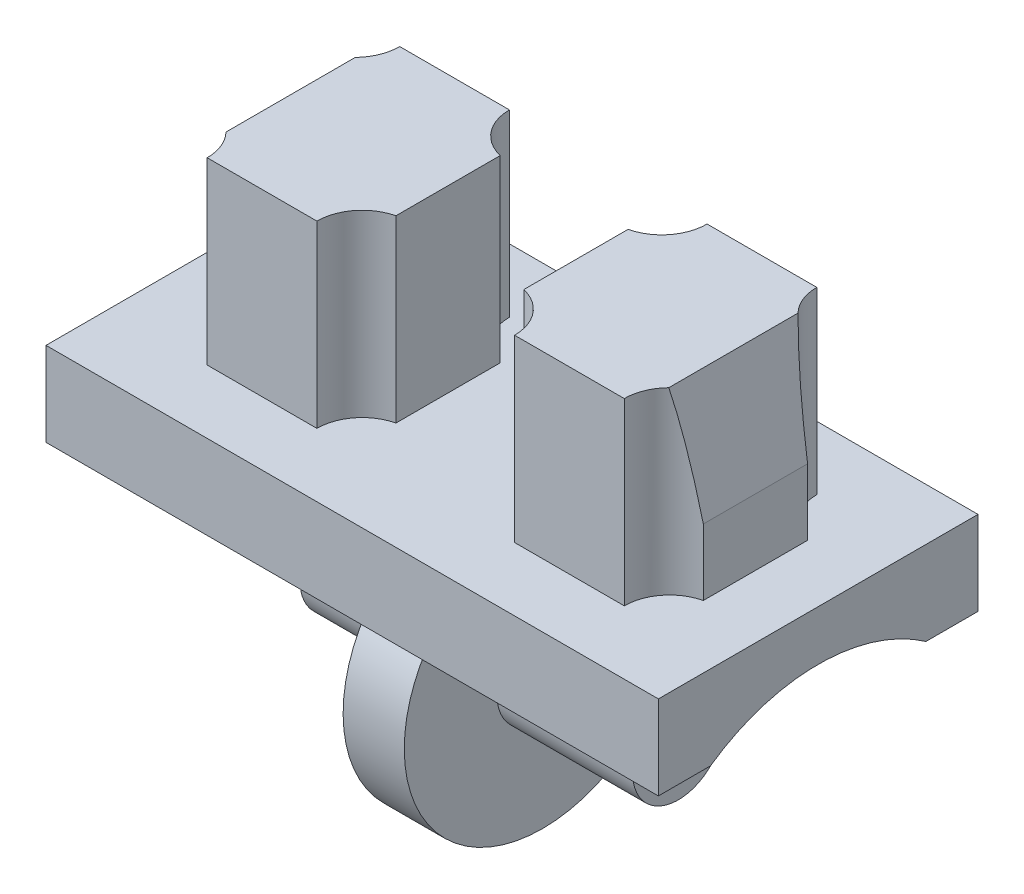
ISO-10303-21;
HEADER;
FILE_DESCRIPTION(('STEP AP214'),'2;1');
FILE_NAME('part.step','',(''),(''),'','','');
FILE_SCHEMA(('AUTOMOTIVE_DESIGN { 1 0 10303 214 1 1 1 1 }'));
ENDSEC;
DATA;
#1=APPLICATION_CONTEXT('core data for automotive mechanical design processes');
#2=APPLICATION_PROTOCOL_DEFINITION('international standard','automotive_design',2000,#1);
#3=PRODUCT_CONTEXT('',#1,'mechanical');
#4=PRODUCT('Part','Part','',(#3));
#5=PRODUCT_RELATED_PRODUCT_CATEGORY('part','',(#4));
#6=PRODUCT_DEFINITION_FORMATION('','',#4);
#7=PRODUCT_DEFINITION_CONTEXT('part definition',#1,'design');
#8=PRODUCT_DEFINITION('design','',#6,#7);
#9=PRODUCT_DEFINITION_SHAPE('','',#8);
#10=(LENGTH_UNIT() NAMED_UNIT(*) SI_UNIT(.MILLI.,.METRE.));
#11=(NAMED_UNIT(*) PLANE_ANGLE_UNIT() SI_UNIT($,.RADIAN.));
#12=(NAMED_UNIT(*) SI_UNIT($,.STERADIAN.) SOLID_ANGLE_UNIT());
#13=UNCERTAINTY_MEASURE_WITH_UNIT(LENGTH_MEASURE(1.E-05),#10,'distance_accuracy_value','');
#14=(GEOMETRIC_REPRESENTATION_CONTEXT(3) GLOBAL_UNCERTAINTY_ASSIGNED_CONTEXT((#13)) GLOBAL_UNIT_ASSIGNED_CONTEXT((#10,
#11,#12)) REPRESENTATION_CONTEXT('',''));
#15=CARTESIAN_POINT('',(0.,0.,0.));
#16=DIRECTION('',(0.,0.,1.));
#17=DIRECTION('',(1.,0.,0.));
#18=AXIS2_PLACEMENT_3D('',#15,#16,#17);
#19=CARTESIAN_POINT('',(-15.52,-6.01710689330767,4.05));
#20=DIRECTION('',(1.,0.,0.));
#21=DIRECTION('',(0.,0.,-1.));
#22=AXIS2_PLACEMENT_3D('',#19,#20,#21);
#23=CYLINDRICAL_SURFACE('',#22,4.75);
#24=DIRECTION('',(1.,0.,0.));
#25=VECTOR('',#24,1.);
#26=CARTESIAN_POINT('',(-15.52,-2.13,1.32));
#27=LINE('',#26,#25);
#28=CARTESIAN_POINT('',(-15.52,-2.13,1.32));
#29=VERTEX_POINT('',#28);
#30=CARTESIAN_POINT('',(-8.535,-2.13,1.32));
#31=VERTEX_POINT('',#30);
#32=EDGE_CURVE('E279',#29,#31,#27,.T.);
#33=ORIENTED_EDGE('',*,*,#32,.T.);
#34=CARTESIAN_POINT('',(-8.535,-6.01710689330767,4.05));
#35=DIRECTION('',(1.,0.,0.));
#36=DIRECTION('',(0.,0.,-1.));
#37=AXIS2_PLACEMENT_3D('',#34,#35,#36);
#38=CIRCLE('',#37,4.75);
#39=CARTESIAN_POINT('',(-8.535,-2.13,6.78));
#40=VERTEX_POINT('',#39);
#41=EDGE_CURVE('E682',#40,#31,#38,.F.);
#42=ORIENTED_EDGE('',*,*,#41,.F.);
#43=DIRECTION('',(1.,0.,0.));
#44=VECTOR('',#43,1.);
#45=CARTESIAN_POINT('',(-15.52,-2.13,6.78));
#46=LINE('',#45,#44);
#47=CARTESIAN_POINT('',(-15.52,-2.13,6.78));
#48=VERTEX_POINT('',#47);
#49=EDGE_CURVE('E262',#48,#40,#46,.T.);
#50=ORIENTED_EDGE('',*,*,#49,.F.);
#51=CARTESIAN_POINT('',(-15.52,-6.01710689330767,4.05));
#52=DIRECTION('',(1.,0.,0.));
#53=DIRECTION('',(0.,0.,-1.));
#54=AXIS2_PLACEMENT_3D('',#51,#52,#53);
#55=CIRCLE('',#54,4.75);
#56=EDGE_CURVE('E263',#48,#29,#55,.F.);
#57=ORIENTED_EDGE('',*,*,#56,.T.);
#58=EDGE_LOOP('',(#33,#42,#50,#57));
#59=FACE_BOUND('',#58,.T.);
#60=ADVANCED_FACE('F45',(#59),#23,.F.);
#61=CARTESIAN_POINT('',(0.,-2.13,0.));
#62=DIRECTION('',(1.,0.,0.));
#63=DIRECTION('',(0.,0.,-1.));
#64=AXIS2_PLACEMENT_3D('',#61,#62,#63);
#65=PLANE('',#64);
#66=DIRECTION('',(0.,0.,-1.));
#67=VECTOR('',#66,1.);
#68=CARTESIAN_POINT('',(0.,-2.13,0.));
#69=LINE('',#68,#67);
#70=CARTESIAN_POINT('',(0.,-2.13,8.1));
#71=VERTEX_POINT('',#70);
#72=CARTESIAN_POINT('',(0.,-2.13,6.78));
#73=VERTEX_POINT('',#72);
#74=EDGE_CURVE('E477',#71,#73,#69,.T.);
#75=ORIENTED_EDGE('',*,*,#74,.T.);
#76=CARTESIAN_POINT('',(0.,-6.01710689330767,4.05));
#77=DIRECTION('',(1.,0.,0.));
#78=DIRECTION('',(0.,0.,-1.));
#79=AXIS2_PLACEMENT_3D('',#76,#77,#78);
#80=CIRCLE('',#79,4.75);
#81=CARTESIAN_POINT('',(0.,-2.13,1.32));
#82=VERTEX_POINT('',#81);
#83=EDGE_CURVE('E259',#73,#82,#80,.F.);
#84=ORIENTED_EDGE('',*,*,#83,.T.);
#85=CARTESIAN_POINT('',(0.,-2.13,0.));
#86=VERTEX_POINT('',#85);
#87=EDGE_CURVE('E481',#82,#86,#69,.T.);
#88=ORIENTED_EDGE('',*,*,#87,.T.);
#89=DIRECTION('',(0.,1.,0.));
#90=VECTOR('',#89,1.);
#91=CARTESIAN_POINT('',(0.,-2.13,0.));
#92=LINE('',#91,#90);
#93=CARTESIAN_POINT('',(0.,0.,0.));
#94=VERTEX_POINT('',#93);
#95=EDGE_CURVE('E494',#86,#94,#92,.T.);
#96=ORIENTED_EDGE('',*,*,#95,.T.);
#97=DIRECTION('',(0.,0.,-1.));
#98=VECTOR('',#97,1.);
#99=CARTESIAN_POINT('',(0.,0.,0.));
#100=LINE('',#99,#98);
#101=CARTESIAN_POINT('',(0.,0.,8.1));
#102=VERTEX_POINT('',#101);
#103=EDGE_CURVE('E476',#102,#94,#100,.T.);
#104=ORIENTED_EDGE('',*,*,#103,.F.);
#105=DIRECTION('',(0.,1.,0.));
#106=VECTOR('',#105,1.);
#107=CARTESIAN_POINT('',(0.,-2.13,8.1));
#108=LINE('',#107,#106);
#109=EDGE_CURVE('E510',#71,#102,#108,.T.);
#110=ORIENTED_EDGE('',*,*,#109,.F.);
#111=EDGE_LOOP('',(#75,#84,#88,#96,#104,#110));
#112=FACE_BOUND('',#111,.T.);
#113=ADVANCED_FACE('F47',(#112),#65,.T.);
#114=CARTESIAN_POINT('',(-15.52,-2.13,0.));
#115=DIRECTION('',(-1.,0.,0.));
#116=DIRECTION('',(0.,0.,1.));
#117=AXIS2_PLACEMENT_3D('',#114,#115,#116);
#118=PLANE('',#117);
#119=DIRECTION('',(0.,0.,1.));
#120=VECTOR('',#119,1.);
#121=CARTESIAN_POINT('',(-15.52,-2.13,0.));
#122=LINE('',#121,#120);
#123=CARTESIAN_POINT('',(-15.52,-2.13,0.));
#124=VERTEX_POINT('',#123);
#125=EDGE_CURVE('E486',#124,#29,#122,.T.);
#126=ORIENTED_EDGE('',*,*,#125,.T.);
#127=ORIENTED_EDGE('',*,*,#56,.F.);
#128=CARTESIAN_POINT('',(-15.52,-2.13,8.1));
#129=VERTEX_POINT('',#128);
#130=EDGE_CURVE('E485',#48,#129,#122,.T.);
#131=ORIENTED_EDGE('',*,*,#130,.T.);
#132=DIRECTION('',(0.,1.,0.));
#133=VECTOR('',#132,1.);
#134=CARTESIAN_POINT('',(-15.52,-2.13,8.1));
#135=LINE('',#134,#133);
#136=CARTESIAN_POINT('',(-15.52,0.,8.1));
#137=VERTEX_POINT('',#136);
#138=EDGE_CURVE('E513',#129,#137,#135,.T.);
#139=ORIENTED_EDGE('',*,*,#138,.T.);
#140=DIRECTION('',(0.,0.,1.));
#141=VECTOR('',#140,1.);
#142=CARTESIAN_POINT('',(-15.52,0.,0.));
#143=LINE('',#142,#141);
#144=CARTESIAN_POINT('',(-15.52,0.,0.));
#145=VERTEX_POINT('',#144);
#146=EDGE_CURVE('E502',#145,#137,#143,.T.);
#147=ORIENTED_EDGE('',*,*,#146,.F.);
#148=DIRECTION('',(0.,1.,0.));
#149=VECTOR('',#148,1.);
#150=CARTESIAN_POINT('',(-15.52,-2.13,0.));
#151=LINE('',#150,#149);
#152=EDGE_CURVE('E516',#124,#145,#151,.T.);
#153=ORIENTED_EDGE('',*,*,#152,.F.);
#154=EDGE_LOOP('',(#126,#127,#131,#139,#147,#153));
#155=FACE_BOUND('',#154,.T.);
#156=ADVANCED_FACE('F577',(#155),#118,.T.);
#157=CARTESIAN_POINT('',(0.,-2.13,0.));
#158=DIRECTION('',(0.,-1.,0.));
#159=DIRECTION('',(0.,0.,-1.));
#160=AXIS2_PLACEMENT_3D('',#157,#158,#159);
#161=PLANE('',#160);
#162=ORIENTED_EDGE('',*,*,#87,.F.);
#163=CARTESIAN_POINT('',(-6.985,-2.13,1.32));
#164=VERTEX_POINT('',#163);
#165=EDGE_CURVE('E283',#164,#82,#27,.T.);
#166=ORIENTED_EDGE('',*,*,#165,.F.);
#167=DIRECTION('',(-1.,0.,0.));
#168=VECTOR('',#167,1.);
#169=CARTESIAN_POINT('',(-6.985,-2.13,1.32));
#170=LINE('',#169,#168);
#171=EDGE_CURVE('E676',#164,#31,#170,.T.);
#172=ORIENTED_EDGE('',*,*,#171,.T.);
#173=ORIENTED_EDGE('',*,*,#32,.F.);
#174=ORIENTED_EDGE('',*,*,#125,.F.);
#175=DIRECTION('',(-1.,0.,0.));
#176=VECTOR('',#175,1.);
#177=CARTESIAN_POINT('',(0.,-2.13,0.));
#178=LINE('',#177,#176);
#179=EDGE_CURVE('E480',#86,#124,#178,.T.);
#180=ORIENTED_EDGE('',*,*,#179,.F.);
#181=EDGE_LOOP('',(#162,#166,#172,#173,#174,#180));
#182=FACE_BOUND('',#181,.T.);
#183=ADVANCED_FACE('F642',(#182),#161,.T.);
#184=ORIENTED_EDGE('',*,*,#130,.F.);
#185=ORIENTED_EDGE('',*,*,#49,.T.);
#186=DIRECTION('',(-1.,0.,0.));
#187=VECTOR('',#186,1.);
#188=CARTESIAN_POINT('',(-6.985,-2.13,6.78));
#189=LINE('',#188,#187);
#190=CARTESIAN_POINT('',(-6.985,-2.13,6.78));
#191=VERTEX_POINT('',#190);
#192=EDGE_CURVE('E250',#191,#40,#189,.T.);
#193=ORIENTED_EDGE('',*,*,#192,.F.);
#194=EDGE_CURVE('E69',#191,#73,#46,.T.);
#195=ORIENTED_EDGE('',*,*,#194,.T.);
#196=ORIENTED_EDGE('',*,*,#74,.F.);
#197=DIRECTION('',(1.,0.,0.));
#198=VECTOR('',#197,1.);
#199=CARTESIAN_POINT('',(0.,-2.13,8.1));
#200=LINE('',#199,#198);
#201=EDGE_CURVE('E490',#129,#71,#200,.T.);
#202=ORIENTED_EDGE('',*,*,#201,.F.);
#203=EDGE_LOOP('',(#184,#185,#193,#195,#196,#202));
#204=FACE_BOUND('',#203,.T.);
#205=ADVANCED_FACE('F267',(#204),#161,.T.);
#206=CARTESIAN_POINT('',(-1.325,4.55,6.49));
#207=DIRECTION('',(0.,-1.,0.));
#208=DIRECTION('',(0.,0.,-1.));
#209=AXIS2_PLACEMENT_3D('',#206,#207,#208);
#210=CYLINDRICAL_SURFACE('',#209,1.15);
#211=CARTESIAN_POINT('',(-1.325,0.319229344102554,6.49));
#212=DIRECTION('',(0.981560518740634,0.191151636272403,0.));
#213=DIRECTION('',(0.191151636272403,-0.981560518740634,0.));
#214=AXIS2_PLACEMENT_3D('',#211,#212,#213);
#215=ELLIPSE('',#214,6.01616613085737,1.15);
#216=CARTESIAN_POINT('',(-2.148911229239,4.55,5.68770935046339));
#217=VERTEX_POINT('',#216);
#218=CARTESIAN_POINT('',(-1.59,1.68,5.37094906282154));
#219=VERTEX_POINT('',#218);
#220=EDGE_CURVE('E303',#217,#219,#215,.F.);
#221=ORIENTED_EDGE('',*,*,#220,.F.);
#222=CARTESIAN_POINT('',(-1.325,4.55,6.49));
#223=DIRECTION('',(0.,-1.,0.));
#224=DIRECTION('',(0.,0.,-1.));
#225=AXIS2_PLACEMENT_3D('',#222,#223,#224);
#226=CIRCLE('',#225,1.15);
#227=CARTESIAN_POINT('',(-2.475,4.55,6.49));
#228=VERTEX_POINT('',#227);
#229=EDGE_CURVE('E406',#228,#217,#226,.T.);
#230=ORIENTED_EDGE('',*,*,#229,.F.);
#231=DIRECTION('',(0.,-1.,0.));
#232=VECTOR('',#231,1.);
#233=CARTESIAN_POINT('',(-2.475,4.55,6.49));
#234=LINE('',#233,#232);
#235=CARTESIAN_POINT('',(-2.475,0.,6.49));
#236=VERTEX_POINT('',#235);
#237=EDGE_CURVE('E460',#228,#236,#234,.T.);
#238=ORIENTED_EDGE('',*,*,#237,.T.);
#239=CARTESIAN_POINT('',(-1.325,0.,6.49));
#240=DIRECTION('',(0.,-1.,0.));
#241=DIRECTION('',(0.,0.,-1.));
#242=AXIS2_PLACEMENT_3D('',#239,#240,#241);
#243=CIRCLE('',#242,1.15);
#244=CARTESIAN_POINT('',(-1.59,0.,5.37094906282154));
#245=VERTEX_POINT('',#244);
#246=EDGE_CURVE('E432',#236,#245,#243,.T.);
#247=ORIENTED_EDGE('',*,*,#246,.T.);
#248=DIRECTION('',(0.,-1.,0.));
#249=VECTOR('',#248,1.);
#250=CARTESIAN_POINT('',(-1.59,4.55,5.37094906282154));
#251=LINE('',#250,#249);
#252=EDGE_CURVE('E457',#219,#245,#251,.T.);
#253=ORIENTED_EDGE('',*,*,#252,.F.);
#254=EDGE_LOOP('',(#221,#230,#238,#247,#253));
#255=FACE_BOUND('',#254,.T.);
#256=ADVANCED_FACE('F531',(#255),#210,.F.);
#257=CARTESIAN_POINT('',(-1.59,4.55,2.72905093717847));
#258=DIRECTION('',(-1.,0.,0.));
#259=DIRECTION('',(0.,0.,1.));
#260=AXIS2_PLACEMENT_3D('',#257,#258,#259);
#261=PLANE('',#260);
#262=DIRECTION('',(0.,0.,1.));
#263=VECTOR('',#262,1.);
#264=CARTESIAN_POINT('',(-1.59,1.68,-6.90405093717846));
#265=LINE('',#264,#263);
#266=CARTESIAN_POINT('',(-1.59,1.68,2.72905093717847));
#267=VERTEX_POINT('',#266);
#268=EDGE_CURVE('E296',#267,#219,#265,.T.);
#269=ORIENTED_EDGE('',*,*,#268,.T.);
#270=ORIENTED_EDGE('',*,*,#252,.T.);
#271=DIRECTION('',(0.,0.,-1.));
#272=VECTOR('',#271,1.);
#273=CARTESIAN_POINT('',(-1.59,0.,2.72905093717847));
#274=LINE('',#273,#272);
#275=CARTESIAN_POINT('',(-1.59,0.,2.72905093717847));
#276=VERTEX_POINT('',#275);
#277=EDGE_CURVE('E436',#245,#276,#274,.T.);
#278=ORIENTED_EDGE('',*,*,#277,.T.);
#279=DIRECTION('',(0.,-1.,0.));
#280=VECTOR('',#279,1.);
#281=CARTESIAN_POINT('',(-1.59,4.55,2.72905093717847));
#282=LINE('',#281,#280);
#283=EDGE_CURVE('E454',#267,#276,#282,.T.);
#284=ORIENTED_EDGE('',*,*,#283,.F.);
#285=EDGE_LOOP('',(#269,#270,#278,#284));
#286=FACE_BOUND('',#285,.T.);
#287=ADVANCED_FACE('F546',(#286),#261,.F.);
#288=CARTESIAN_POINT('',(-1.325,4.55,1.61));
#289=DIRECTION('',(0.,-1.,0.));
#290=DIRECTION('',(0.,0.,-1.));
#291=AXIS2_PLACEMENT_3D('',#288,#289,#290);
#292=CYLINDRICAL_SURFACE('',#291,1.15);
#293=CARTESIAN_POINT('',(-1.325,0.319229344102545,1.61));
#294=DIRECTION('',(0.981560518740634,0.191151636272403,0.));
#295=DIRECTION('',(0.191151636272403,-0.981560518740634,0.));
#296=AXIS2_PLACEMENT_3D('',#293,#294,#295);
#297=ELLIPSE('',#296,6.01616613085737,1.15);
#298=CARTESIAN_POINT('',(-2.148911229239,4.55,2.41229064953661));
#299=VERTEX_POINT('',#298);
#300=EDGE_CURVE('E300',#267,#299,#297,.F.);
#301=ORIENTED_EDGE('',*,*,#300,.F.);
#302=ORIENTED_EDGE('',*,*,#283,.T.);
#303=CARTESIAN_POINT('',(-1.325,0.,1.61));
#304=DIRECTION('',(0.,-1.,0.));
#305=DIRECTION('',(0.,0.,1.));
#306=AXIS2_PLACEMENT_3D('',#303,#304,#305);
#307=CIRCLE('',#306,1.15);
#308=CARTESIAN_POINT('',(-2.475,0.,1.61));
#309=VERTEX_POINT('',#308);
#310=EDGE_CURVE('E440',#276,#309,#307,.T.);
#311=ORIENTED_EDGE('',*,*,#310,.T.);
#312=DIRECTION('',(0.,-1.,0.));
#313=VECTOR('',#312,1.);
#314=CARTESIAN_POINT('',(-2.475,4.55,1.61));
#315=LINE('',#314,#313);
#316=CARTESIAN_POINT('',(-2.475,4.55,1.61));
#317=VERTEX_POINT('',#316);
#318=EDGE_CURVE('E450',#317,#309,#315,.T.);
#319=ORIENTED_EDGE('',*,*,#318,.F.);
#320=CARTESIAN_POINT('',(-1.325,4.55,1.61));
#321=DIRECTION('',(0.,-1.,0.));
#322=DIRECTION('',(0.,0.,1.));
#323=AXIS2_PLACEMENT_3D('',#320,#321,#322);
#324=CIRCLE('',#323,1.15);
#325=EDGE_CURVE('E410',#299,#317,#324,.T.);
#326=ORIENTED_EDGE('',*,*,#325,.F.);
#327=EDGE_LOOP('',(#301,#302,#311,#319,#326));
#328=FACE_BOUND('',#327,.T.);
#329=ADVANCED_FACE('F548',(#328),#292,.F.);
#330=CARTESIAN_POINT('',(-6.405,4.55,1.61));
#331=DIRECTION('',(0.,-1.,0.));
#332=DIRECTION('',(0.,0.,-1.));
#333=AXIS2_PLACEMENT_3D('',#330,#331,#332);
#334=PLANE('',#333);
#335=DIRECTION('',(0.,0.,1.));
#336=VECTOR('',#335,1.);
#337=CARTESIAN_POINT('',(-2.148911229239,4.55,1.61));
#338=LINE('',#337,#336);
#339=EDGE_CURVE('E54',#299,#217,#338,.T.);
#340=ORIENTED_EDGE('',*,*,#339,.F.);
#341=ORIENTED_EDGE('',*,*,#325,.T.);
#342=DIRECTION('',(-1.,0.,0.));
#343=VECTOR('',#342,1.);
#344=CARTESIAN_POINT('',(-2.47499999999999,4.55,1.61));
#345=LINE('',#344,#343);
#346=CARTESIAN_POINT('',(-5.255,4.55,1.61));
#347=VERTEX_POINT('',#346);
#348=EDGE_CURVE('E413',#317,#347,#345,.T.);
#349=ORIENTED_EDGE('',*,*,#348,.T.);
#350=CARTESIAN_POINT('',(-6.405,4.55,1.61));
#351=DIRECTION('',(0.,-1.,0.));
#352=DIRECTION('',(0.,0.,-1.));
#353=AXIS2_PLACEMENT_3D('',#350,#351,#352);
#354=CIRCLE('',#353,1.15);
#355=CARTESIAN_POINT('',(-6.13999999999999,4.55,2.72905093717847));
#356=VERTEX_POINT('',#355);
#357=EDGE_CURVE('E392',#347,#356,#354,.T.);
#358=ORIENTED_EDGE('',*,*,#357,.T.);
#359=DIRECTION('',(0.,0.,1.));
#360=VECTOR('',#359,1.);
#361=CARTESIAN_POINT('',(-6.13999999999999,4.55,2.72905093717847));
#362=LINE('',#361,#360);
#363=CARTESIAN_POINT('',(-6.14,4.55,5.37094906282154));
#364=VERTEX_POINT('',#363);
#365=EDGE_CURVE('E396',#356,#364,#362,.T.);
#366=ORIENTED_EDGE('',*,*,#365,.T.);
#367=CARTESIAN_POINT('',(-6.405,4.55,6.49));
#368=DIRECTION('',(0.,-1.,0.));
#369=DIRECTION('',(0.,0.,1.));
#370=AXIS2_PLACEMENT_3D('',#367,#368,#369);
#371=CIRCLE('',#370,1.15);
#372=CARTESIAN_POINT('',(-5.255,4.55,6.49));
#373=VERTEX_POINT('',#372);
#374=EDGE_CURVE('E400',#364,#373,#371,.T.);
#375=ORIENTED_EDGE('',*,*,#374,.T.);
#376=DIRECTION('',(1.,0.,0.));
#377=VECTOR('',#376,1.);
#378=CARTESIAN_POINT('',(-2.475,4.55,6.49));
#379=LINE('',#378,#377);
#380=EDGE_CURVE('E403',#373,#228,#379,.T.);
#381=ORIENTED_EDGE('',*,*,#380,.T.);
#382=ORIENTED_EDGE('',*,*,#229,.T.);
#383=EDGE_LOOP('',(#340,#341,#349,#358,#366,#375,#381,#382));
#384=FACE_BOUND('',#383,.T.);
#385=ADVANCED_FACE('F532',(#384),#334,.F.);
#386=CARTESIAN_POINT('',(0.,0.,0.));
#387=DIRECTION('',(0.,-1.,0.));
#388=DIRECTION('',(0.,0.,-1.));
#389=AXIS2_PLACEMENT_3D('',#386,#387,#388);
#390=PLANE('',#389);
#391=CARTESIAN_POINT('',(-6.405,0.,1.61));
#392=DIRECTION('',(0.,-1.,0.));
#393=DIRECTION('',(0.,0.,-1.));
#394=AXIS2_PLACEMENT_3D('',#391,#392,#393);
#395=CIRCLE('',#394,1.15);
#396=CARTESIAN_POINT('',(-5.255,0.,1.61));
#397=VERTEX_POINT('',#396);
#398=CARTESIAN_POINT('',(-6.13999999999999,0.,2.72905093717847));
#399=VERTEX_POINT('',#398);
#400=EDGE_CURVE('E370',#397,#399,#395,.T.);
#401=ORIENTED_EDGE('',*,*,#400,.F.);
#402=DIRECTION('',(-1.,0.,0.));
#403=VECTOR('',#402,1.);
#404=CARTESIAN_POINT('',(-2.47499999999999,0.,1.61));
#405=LINE('',#404,#403);
#406=EDGE_CURVE('E397',#309,#397,#405,.T.);
#407=ORIENTED_EDGE('',*,*,#406,.F.);
#408=ORIENTED_EDGE('',*,*,#310,.F.);
#409=ORIENTED_EDGE('',*,*,#277,.F.);
#410=ORIENTED_EDGE('',*,*,#246,.F.);
#411=DIRECTION('',(1.,0.,0.));
#412=VECTOR('',#411,1.);
#413=CARTESIAN_POINT('',(-2.475,0.,6.49));
#414=LINE('',#413,#412);
#415=CARTESIAN_POINT('',(-5.255,0.,6.49));
#416=VERTEX_POINT('',#415);
#417=EDGE_CURVE('E428',#416,#236,#414,.T.);
#418=ORIENTED_EDGE('',*,*,#417,.F.);
#419=CARTESIAN_POINT('',(-6.405,0.,6.49));
#420=DIRECTION('',(0.,-1.,0.));
#421=DIRECTION('',(0.,0.,1.));
#422=AXIS2_PLACEMENT_3D('',#419,#420,#421);
#423=CIRCLE('',#422,1.15);
#424=CARTESIAN_POINT('',(-6.14,0.,5.37094906282154));
#425=VERTEX_POINT('',#424);
#426=EDGE_CURVE('E424',#425,#416,#423,.T.);
#427=ORIENTED_EDGE('',*,*,#426,.F.);
#428=DIRECTION('',(0.,0.,1.));
#429=VECTOR('',#428,1.);
#430=CARTESIAN_POINT('',(-6.13999999999999,0.,2.72905093717847));
#431=LINE('',#430,#429);
#432=EDGE_CURVE('E420',#399,#425,#431,.T.);
#433=ORIENTED_EDGE('',*,*,#432,.F.);
#434=EDGE_LOOP('',(#401,#407,#408,#409,#410,#418,#427,#433));
#435=FACE_BOUND('',#434,.T.);
#436=ORIENTED_EDGE('',*,*,#103,.T.);
#437=DIRECTION('',(-1.,0.,0.));
#438=VECTOR('',#437,1.);
#439=CARTESIAN_POINT('',(0.,0.,0.));
#440=LINE('',#439,#438);
#441=EDGE_CURVE('E498',#94,#145,#440,.T.);
#442=ORIENTED_EDGE('',*,*,#441,.T.);
#443=ORIENTED_EDGE('',*,*,#146,.T.);
#444=DIRECTION('',(1.,0.,0.));
#445=VECTOR('',#444,1.);
#446=CARTESIAN_POINT('',(0.,0.,8.1));
#447=LINE('',#446,#445);
#448=EDGE_CURVE('E506',#137,#102,#447,.T.);
#449=ORIENTED_EDGE('',*,*,#448,.T.);
#450=EDGE_LOOP('',(#436,#442,#443,#449));
#451=FACE_BOUND('',#450,.T.);
#452=CARTESIAN_POINT('',(-9.115,0.,6.49));
#453=DIRECTION('',(0.,-1.,0.));
#454=DIRECTION('',(0.,0.,-1.));
#455=AXIS2_PLACEMENT_3D('',#452,#453,#454);
#456=CIRCLE('',#455,1.15);
#457=CARTESIAN_POINT('',(-10.265,0.,6.49));
#458=VERTEX_POINT('',#457);
#459=CARTESIAN_POINT('',(-9.38,0.,5.37094906282154));
#460=VERTEX_POINT('',#459);
#461=EDGE_CURVE('E366',#458,#460,#456,.T.);
#462=ORIENTED_EDGE('',*,*,#461,.F.);
#463=DIRECTION('',(1.,0.,0.));
#464=VECTOR('',#463,1.);
#465=CARTESIAN_POINT('',(-13.045,0.,6.49));
#466=LINE('',#465,#464);
#467=CARTESIAN_POINT('',(-13.045,0.,6.49));
#468=VERTEX_POINT('',#467);
#469=EDGE_CURVE('E337',#468,#458,#466,.T.);
#470=ORIENTED_EDGE('',*,*,#469,.F.);
#471=CARTESIAN_POINT('',(-14.195,0.,6.49));
#472=DIRECTION('',(0.,-1.,0.));
#473=DIRECTION('',(0.,0.,1.));
#474=AXIS2_PLACEMENT_3D('',#471,#472,#473);
#475=CIRCLE('',#474,1.15);
#476=CARTESIAN_POINT('',(-13.93,0.,5.37094906282154));
#477=VERTEX_POINT('',#476);
#478=EDGE_CURVE('E341',#477,#468,#475,.T.);
#479=ORIENTED_EDGE('',*,*,#478,.F.);
#480=DIRECTION('',(0.,0.,1.));
#481=VECTOR('',#480,1.);
#482=CARTESIAN_POINT('',(-13.93,0.,2.72905093717847));
#483=LINE('',#482,#481);
#484=CARTESIAN_POINT('',(-13.93,0.,2.72905093717847));
#485=VERTEX_POINT('',#484);
#486=EDGE_CURVE('E346',#485,#477,#483,.T.);
#487=ORIENTED_EDGE('',*,*,#486,.F.);
#488=CARTESIAN_POINT('',(-14.195,0.,1.61));
#489=DIRECTION('',(0.,-1.,0.));
#490=DIRECTION('',(0.,0.,-1.));
#491=AXIS2_PLACEMENT_3D('',#488,#489,#490);
#492=CIRCLE('',#491,1.15);
#493=CARTESIAN_POINT('',(-13.045,0.,1.61));
#494=VERTEX_POINT('',#493);
#495=EDGE_CURVE('E350',#494,#485,#492,.T.);
#496=ORIENTED_EDGE('',*,*,#495,.F.);
#497=DIRECTION('',(-1.,0.,0.));
#498=VECTOR('',#497,1.);
#499=CARTESIAN_POINT('',(-13.045,0.,1.61));
#500=LINE('',#499,#498);
#501=CARTESIAN_POINT('',(-10.265,0.,1.61));
#502=VERTEX_POINT('',#501);
#503=EDGE_CURVE('E354',#502,#494,#500,.T.);
#504=ORIENTED_EDGE('',*,*,#503,.F.);
#505=CARTESIAN_POINT('',(-9.115,0.,1.61));
#506=DIRECTION('',(0.,-1.,0.));
#507=DIRECTION('',(0.,0.,1.));
#508=AXIS2_PLACEMENT_3D('',#505,#506,#507);
#509=CIRCLE('',#508,1.15);
#510=CARTESIAN_POINT('',(-9.38,0.,2.72905093717847));
#511=VERTEX_POINT('',#510);
#512=EDGE_CURVE('E358',#511,#502,#509,.T.);
#513=ORIENTED_EDGE('',*,*,#512,.F.);
#514=DIRECTION('',(0.,0.,-1.));
#515=VECTOR('',#514,1.);
#516=CARTESIAN_POINT('',(-9.38,0.,2.72905093717847));
#517=LINE('',#516,#515);
#518=EDGE_CURVE('E362',#460,#511,#517,.T.);
#519=ORIENTED_EDGE('',*,*,#518,.F.);
#520=EDGE_LOOP('',(#462,#470,#479,#487,#496,#504,#513,#519));
#521=FACE_BOUND('',#520,.T.);
#522=ADVANCED_FACE('F541',(#435,#451,#521),#390,.F.);
#523=CARTESIAN_POINT('',(0.,-2.13,8.1));
#524=DIRECTION('',(0.,0.,1.));
#525=DIRECTION('',(1.,0.,0.));
#526=AXIS2_PLACEMENT_3D('',#523,#524,#525);
#527=PLANE('',#526);
#528=ORIENTED_EDGE('',*,*,#448,.F.);
#529=ORIENTED_EDGE('',*,*,#138,.F.);
#530=ORIENTED_EDGE('',*,*,#201,.T.);
#531=ORIENTED_EDGE('',*,*,#109,.T.);
#532=EDGE_LOOP('',(#528,#529,#530,#531));
#533=FACE_BOUND('',#532,.T.);
#534=ADVANCED_FACE('F652',(#533),#527,.T.);
#535=CARTESIAN_POINT('',(0.,-2.13,0.));
#536=DIRECTION('',(0.,0.,-1.));
#537=DIRECTION('',(-1.,0.,0.));
#538=AXIS2_PLACEMENT_3D('',#535,#536,#537);
#539=PLANE('',#538);
#540=ORIENTED_EDGE('',*,*,#441,.F.);
#541=ORIENTED_EDGE('',*,*,#95,.F.);
#542=ORIENTED_EDGE('',*,*,#179,.T.);
#543=ORIENTED_EDGE('',*,*,#152,.T.);
#544=EDGE_LOOP('',(#540,#541,#542,#543));
#545=FACE_BOUND('',#544,.T.);
#546=ADVANCED_FACE('F655',(#545),#539,.T.);
#547=CARTESIAN_POINT('',(-6.405,4.55,1.61));
#548=DIRECTION('',(0.,-1.,0.));
#549=DIRECTION('',(0.,0.,-1.));
#550=AXIS2_PLACEMENT_3D('',#547,#548,#549);
#551=CYLINDRICAL_SURFACE('',#550,1.15);
#552=ORIENTED_EDGE('',*,*,#400,.T.);
#553=DIRECTION('',(0.,-1.,0.));
#554=VECTOR('',#553,1.);
#555=CARTESIAN_POINT('',(-6.13999999999999,4.55,2.72905093717847));
#556=LINE('',#555,#554);
#557=EDGE_CURVE('E472',#356,#399,#556,.T.);
#558=ORIENTED_EDGE('',*,*,#557,.F.);
#559=ORIENTED_EDGE('',*,*,#357,.F.);
#560=DIRECTION('',(0.,-1.,0.));
#561=VECTOR('',#560,1.);
#562=CARTESIAN_POINT('',(-5.255,4.55,1.61));
#563=LINE('',#562,#561);
#564=EDGE_CURVE('E416',#347,#397,#563,.T.);
#565=ORIENTED_EDGE('',*,*,#564,.T.);
#566=EDGE_LOOP('',(#552,#558,#559,#565));
#567=FACE_BOUND('',#566,.T.);
#568=ADVANCED_FACE('F557',(#567),#551,.F.);
#569=CARTESIAN_POINT('',(-6.13999999999999,4.55,2.72905093717847));
#570=DIRECTION('',(1.,0.,0.));
#571=DIRECTION('',(0.,0.,-1.));
#572=AXIS2_PLACEMENT_3D('',#569,#570,#571);
#573=PLANE('',#572);
#574=ORIENTED_EDGE('',*,*,#432,.T.);
#575=DIRECTION('',(0.,-1.,0.));
#576=VECTOR('',#575,1.);
#577=CARTESIAN_POINT('',(-6.14,4.55,5.37094906282154));
#578=LINE('',#577,#576);
#579=EDGE_CURVE('E468',#364,#425,#578,.T.);
#580=ORIENTED_EDGE('',*,*,#579,.F.);
#581=ORIENTED_EDGE('',*,*,#365,.F.);
#582=ORIENTED_EDGE('',*,*,#557,.T.);
#583=EDGE_LOOP('',(#574,#580,#581,#582));
#584=FACE_BOUND('',#583,.T.);
#585=ADVANCED_FACE('F559',(#584),#573,.F.);
#586=CARTESIAN_POINT('',(-6.405,4.55,6.49));
#587=DIRECTION('',(0.,-1.,0.));
#588=DIRECTION('',(0.,0.,-1.));
#589=AXIS2_PLACEMENT_3D('',#586,#587,#588);
#590=CYLINDRICAL_SURFACE('',#589,1.15);
#591=ORIENTED_EDGE('',*,*,#426,.T.);
#592=DIRECTION('',(0.,-1.,0.));
#593=VECTOR('',#592,1.);
#594=CARTESIAN_POINT('',(-5.255,4.55,6.49));
#595=LINE('',#594,#593);
#596=EDGE_CURVE('E464',#373,#416,#595,.T.);
#597=ORIENTED_EDGE('',*,*,#596,.F.);
#598=ORIENTED_EDGE('',*,*,#374,.F.);
#599=ORIENTED_EDGE('',*,*,#579,.T.);
#600=EDGE_LOOP('',(#591,#597,#598,#599));
#601=FACE_BOUND('',#600,.T.);
#602=ADVANCED_FACE('F562',(#601),#590,.F.);
#603=CARTESIAN_POINT('',(-2.475,4.55,6.49));
#604=DIRECTION('',(0.,0.,-1.));
#605=DIRECTION('',(-1.,0.,0.));
#606=AXIS2_PLACEMENT_3D('',#603,#604,#605);
#607=PLANE('',#606);
#608=ORIENTED_EDGE('',*,*,#417,.T.);
#609=ORIENTED_EDGE('',*,*,#237,.F.);
#610=ORIENTED_EDGE('',*,*,#380,.F.);
#611=ORIENTED_EDGE('',*,*,#596,.T.);
#612=EDGE_LOOP('',(#608,#609,#610,#611));
#613=FACE_BOUND('',#612,.T.);
#614=ADVANCED_FACE('F538',(#613),#607,.F.);
#615=CARTESIAN_POINT('',(-2.47499999999999,4.55,1.61));
#616=DIRECTION('',(0.,0.,1.));
#617=DIRECTION('',(1.,0.,0.));
#618=AXIS2_PLACEMENT_3D('',#615,#616,#617);
#619=PLANE('',#618);
#620=ORIENTED_EDGE('',*,*,#406,.T.);
#621=ORIENTED_EDGE('',*,*,#564,.F.);
#622=ORIENTED_EDGE('',*,*,#348,.F.);
#623=ORIENTED_EDGE('',*,*,#318,.T.);
#624=EDGE_LOOP('',(#620,#621,#622,#623));
#625=FACE_BOUND('',#624,.T.);
#626=ADVANCED_FACE('F555',(#625),#619,.F.);
#627=CARTESIAN_POINT('',(-9.115,4.55,6.49));
#628=DIRECTION('',(0.,-1.,0.));
#629=DIRECTION('',(0.,0.,-1.));
#630=AXIS2_PLACEMENT_3D('',#627,#628,#629);
#631=CYLINDRICAL_SURFACE('',#630,1.15);
#632=ORIENTED_EDGE('',*,*,#461,.T.);
#633=DIRECTION('',(0.,-1.,0.));
#634=VECTOR('',#633,1.);
#635=CARTESIAN_POINT('',(-9.38,4.55,5.37094906282154));
#636=LINE('',#635,#634);
#637=CARTESIAN_POINT('',(-9.38,4.55,5.37094906282154));
#638=VERTEX_POINT('',#637);
#639=EDGE_CURVE('E306',#638,#460,#636,.T.);
#640=ORIENTED_EDGE('',*,*,#639,.F.);
#641=CARTESIAN_POINT('',(-9.115,4.55,6.49));
#642=DIRECTION('',(0.,-1.,0.));
#643=DIRECTION('',(0.,0.,-1.));
#644=AXIS2_PLACEMENT_3D('',#641,#642,#643);
#645=CIRCLE('',#644,1.15);
#646=CARTESIAN_POINT('',(-10.265,4.55,6.49));
#647=VERTEX_POINT('',#646);
#648=EDGE_CURVE('E342',#647,#638,#645,.T.);
#649=ORIENTED_EDGE('',*,*,#648,.F.);
#650=DIRECTION('',(0.,-1.,0.));
#651=VECTOR('',#650,1.);
#652=CARTESIAN_POINT('',(-10.265,4.55,6.49));
#653=LINE('',#652,#651);
#654=EDGE_CURVE('E332',#647,#458,#653,.T.);
#655=ORIENTED_EDGE('',*,*,#654,.T.);
#656=EDGE_LOOP('',(#632,#640,#649,#655));
#657=FACE_BOUND('',#656,.T.);
#658=ADVANCED_FACE('F595',(#657),#631,.F.);
#659=CARTESIAN_POINT('',(-9.38,4.55,2.72905093717847));
#660=DIRECTION('',(-1.,0.,0.));
#661=DIRECTION('',(0.,0.,1.));
#662=AXIS2_PLACEMENT_3D('',#659,#660,#661);
#663=PLANE('',#662);
#664=ORIENTED_EDGE('',*,*,#518,.T.);
#665=DIRECTION('',(0.,-1.,0.));
#666=VECTOR('',#665,1.);
#667=CARTESIAN_POINT('',(-9.38,4.55,2.72905093717847));
#668=LINE('',#667,#666);
#669=CARTESIAN_POINT('',(-9.38,4.55,2.72905093717847));
#670=VERTEX_POINT('',#669);
#671=EDGE_CURVE('E310',#670,#511,#668,.T.);
#672=ORIENTED_EDGE('',*,*,#671,.F.);
#673=DIRECTION('',(0.,0.,-1.));
#674=VECTOR('',#673,1.);
#675=CARTESIAN_POINT('',(-9.38,4.55,2.72905093717847));
#676=LINE('',#675,#674);
#677=EDGE_CURVE('E386',#638,#670,#676,.T.);
#678=ORIENTED_EDGE('',*,*,#677,.F.);
#679=ORIENTED_EDGE('',*,*,#639,.T.);
#680=EDGE_LOOP('',(#664,#672,#678,#679));
#681=FACE_BOUND('',#680,.T.);
#682=ADVANCED_FACE('F598',(#681),#663,.F.);
#683=CARTESIAN_POINT('',(-9.115,4.55,1.61));
#684=DIRECTION('',(0.,-1.,0.));
#685=DIRECTION('',(0.,0.,-1.));
#686=AXIS2_PLACEMENT_3D('',#683,#684,#685);
#687=CYLINDRICAL_SURFACE('',#686,1.15);
#688=ORIENTED_EDGE('',*,*,#512,.T.);
#689=DIRECTION('',(0.,-1.,0.));
#690=VECTOR('',#689,1.);
#691=CARTESIAN_POINT('',(-10.265,4.55,1.61));
#692=LINE('',#691,#690);
#693=CARTESIAN_POINT('',(-10.265,4.55,1.61));
#694=VERTEX_POINT('',#693);
#695=EDGE_CURVE('E314',#694,#502,#692,.T.);
#696=ORIENTED_EDGE('',*,*,#695,.F.);
#697=CARTESIAN_POINT('',(-9.115,4.55,1.61));
#698=DIRECTION('',(0.,-1.,0.));
#699=DIRECTION('',(0.,0.,1.));
#700=AXIS2_PLACEMENT_3D('',#697,#698,#699);
#701=CIRCLE('',#700,1.15);
#702=EDGE_CURVE('E383',#670,#694,#701,.T.);
#703=ORIENTED_EDGE('',*,*,#702,.F.);
#704=ORIENTED_EDGE('',*,*,#671,.T.);
#705=EDGE_LOOP('',(#688,#696,#703,#704));
#706=FACE_BOUND('',#705,.T.);
#707=ADVANCED_FACE('F602',(#706),#687,.F.);
#708=CARTESIAN_POINT('',(-13.045,4.55,1.61));
#709=DIRECTION('',(0.,0.,1.));
#710=DIRECTION('',(1.,0.,0.));
#711=AXIS2_PLACEMENT_3D('',#708,#709,#710);
#712=PLANE('',#711);
#713=ORIENTED_EDGE('',*,*,#503,.T.);
#714=DIRECTION('',(0.,-1.,0.));
#715=VECTOR('',#714,1.);
#716=CARTESIAN_POINT('',(-13.045,4.55,1.61));
#717=LINE('',#716,#715);
#718=CARTESIAN_POINT('',(-13.045,4.55,1.61));
#719=VERTEX_POINT('',#718);
#720=EDGE_CURVE('E318',#719,#494,#717,.T.);
#721=ORIENTED_EDGE('',*,*,#720,.F.);
#722=DIRECTION('',(-1.,0.,0.));
#723=VECTOR('',#722,1.);
#724=CARTESIAN_POINT('',(-13.045,4.55,1.61));
#725=LINE('',#724,#723);
#726=EDGE_CURVE('E380',#694,#719,#725,.T.);
#727=ORIENTED_EDGE('',*,*,#726,.F.);
#728=ORIENTED_EDGE('',*,*,#695,.T.);
#729=EDGE_LOOP('',(#713,#721,#727,#728));
#730=FACE_BOUND('',#729,.T.);
#731=ADVANCED_FACE('F606',(#730),#712,.F.);
#732=CARTESIAN_POINT('',(-14.195,4.55,1.61));
#733=DIRECTION('',(0.,-1.,0.));
#734=DIRECTION('',(0.,0.,-1.));
#735=AXIS2_PLACEMENT_3D('',#732,#733,#734);
#736=CYLINDRICAL_SURFACE('',#735,1.15);
#737=DIRECTION('',(0.,-1.,0.));
#738=VECTOR('',#737,1.);
#739=CARTESIAN_POINT('',(-13.93,4.55,2.72905093717847));
#740=LINE('',#739,#738);
#741=CARTESIAN_POINT('',(-13.93,1.68,2.72905093717847));
#742=VERTEX_POINT('',#741);
#743=EDGE_CURVE('E322',#742,#485,#740,.T.);
#744=ORIENTED_EDGE('',*,*,#743,.F.);
#745=CARTESIAN_POINT('',(-14.195,0.319229344102555,1.61));
#746=DIRECTION('',(0.981560518740634,-0.191151636272403,0.));
#747=DIRECTION('',(-0.191151636272403,-0.981560518740634,0.));
#748=AXIS2_PLACEMENT_3D('',#745,#746,#747);
#749=ELLIPSE('',#748,6.01616613085738,1.15);
#750=CARTESIAN_POINT('',(-13.371088770761,4.55,2.41229064953662));
#751=VERTEX_POINT('',#750);
#752=EDGE_CURVE('E292',#742,#751,#749,.F.);
#753=ORIENTED_EDGE('',*,*,#752,.T.);
#754=CARTESIAN_POINT('',(-14.195,4.55,1.61));
#755=DIRECTION('',(0.,-1.,0.));
#756=DIRECTION('',(0.,0.,-1.));
#757=AXIS2_PLACEMENT_3D('',#754,#755,#756);
#758=CIRCLE('',#757,1.15);
#759=EDGE_CURVE('E376',#719,#751,#758,.T.);
#760=ORIENTED_EDGE('',*,*,#759,.F.);
#761=ORIENTED_EDGE('',*,*,#720,.T.);
#762=ORIENTED_EDGE('',*,*,#495,.T.);
#763=EDGE_LOOP('',(#744,#753,#760,#761,#762));
#764=FACE_BOUND('',#763,.T.);
#765=ADVANCED_FACE('F610',(#764),#736,.F.);
#766=CARTESIAN_POINT('',(-13.93,4.55,2.72905093717847));
#767=DIRECTION('',(1.,0.,0.));
#768=DIRECTION('',(0.,0.,-1.));
#769=AXIS2_PLACEMENT_3D('',#766,#767,#768);
#770=PLANE('',#769);
#771=DIRECTION('',(0.,-1.,0.));
#772=VECTOR('',#771,1.);
#773=CARTESIAN_POINT('',(-13.93,4.55,5.37094906282154));
#774=LINE('',#773,#772);
#775=CARTESIAN_POINT('',(-13.93,1.68,5.37094906282154));
#776=VERTEX_POINT('',#775);
#777=EDGE_CURVE('E325',#776,#477,#774,.T.);
#778=ORIENTED_EDGE('',*,*,#777,.F.);
#779=DIRECTION('',(0.,0.,1.));
#780=VECTOR('',#779,1.);
#781=CARTESIAN_POINT('',(-13.93,1.68,-6.90405093717846));
#782=LINE('',#781,#780);
#783=EDGE_CURVE('E282',#742,#776,#782,.T.);
#784=ORIENTED_EDGE('',*,*,#783,.F.);
#785=ORIENTED_EDGE('',*,*,#743,.T.);
#786=ORIENTED_EDGE('',*,*,#486,.T.);
#787=EDGE_LOOP('',(#778,#784,#785,#786));
#788=FACE_BOUND('',#787,.T.);
#789=ADVANCED_FACE('F614',(#788),#770,.F.);
#790=CARTESIAN_POINT('',(-14.195,4.55,6.49));
#791=DIRECTION('',(0.,-1.,0.));
#792=DIRECTION('',(0.,0.,-1.));
#793=AXIS2_PLACEMENT_3D('',#790,#791,#792);
#794=CYLINDRICAL_SURFACE('',#793,1.15);
#795=CARTESIAN_POINT('',(-14.195,4.55,6.49));
#796=DIRECTION('',(0.,-1.,0.));
#797=DIRECTION('',(0.,0.,1.));
#798=AXIS2_PLACEMENT_3D('',#795,#796,#797);
#799=CIRCLE('',#798,1.15);
#800=CARTESIAN_POINT('',(-13.371088770761,4.55,5.68770935046339));
#801=VERTEX_POINT('',#800);
#802=CARTESIAN_POINT('',(-13.045,4.55,6.49));
#803=VERTEX_POINT('',#802);
#804=EDGE_CURVE('E373',#801,#803,#799,.T.);
#805=ORIENTED_EDGE('',*,*,#804,.F.);
#806=CARTESIAN_POINT('',(-14.195,0.319229344102555,6.49));
#807=DIRECTION('',(0.981560518740634,-0.191151636272403,0.));
#808=DIRECTION('',(-0.191151636272403,-0.981560518740634,0.));
#809=AXIS2_PLACEMENT_3D('',#806,#807,#808);
#810=ELLIPSE('',#809,6.01616613085738,1.15);
#811=EDGE_CURVE('E288',#801,#776,#810,.F.);
#812=ORIENTED_EDGE('',*,*,#811,.T.);
#813=ORIENTED_EDGE('',*,*,#777,.T.);
#814=ORIENTED_EDGE('',*,*,#478,.T.);
#815=DIRECTION('',(0.,-1.,0.));
#816=VECTOR('',#815,1.);
#817=CARTESIAN_POINT('',(-13.045,4.55,6.49));
#818=LINE('',#817,#816);
#819=EDGE_CURVE('E328',#803,#468,#818,.T.);
#820=ORIENTED_EDGE('',*,*,#819,.F.);
#821=EDGE_LOOP('',(#805,#812,#813,#814,#820));
#822=FACE_BOUND('',#821,.T.);
#823=ADVANCED_FACE('F618',(#822),#794,.F.);
#824=CARTESIAN_POINT('',(-13.045,4.55,6.49));
#825=DIRECTION('',(0.,0.,-1.));
#826=DIRECTION('',(-1.,0.,0.));
#827=AXIS2_PLACEMENT_3D('',#824,#825,#826);
#828=PLANE('',#827);
#829=ORIENTED_EDGE('',*,*,#469,.T.);
#830=ORIENTED_EDGE('',*,*,#654,.F.);
#831=DIRECTION('',(1.,0.,0.));
#832=VECTOR('',#831,1.);
#833=CARTESIAN_POINT('',(-13.045,4.55,6.49));
#834=LINE('',#833,#832);
#835=EDGE_CURVE('E336',#803,#647,#834,.T.);
#836=ORIENTED_EDGE('',*,*,#835,.F.);
#837=ORIENTED_EDGE('',*,*,#819,.T.);
#838=EDGE_LOOP('',(#829,#830,#836,#837));
#839=FACE_BOUND('',#838,.T.);
#840=ADVANCED_FACE('F622',(#839),#828,.F.);
#841=CARTESIAN_POINT('',(-9.115,4.55,6.49));
#842=DIRECTION('',(0.,-1.,0.));
#843=DIRECTION('',(0.,0.,-1.));
#844=AXIS2_PLACEMENT_3D('',#841,#842,#843);
#845=PLANE('',#844);
#846=ORIENTED_EDGE('',*,*,#759,.T.);
#847=DIRECTION('',(0.,0.,1.));
#848=VECTOR('',#847,1.);
#849=CARTESIAN_POINT('',(-13.371088770761,4.55,6.49));
#850=LINE('',#849,#848);
#851=EDGE_CURVE('E11',#751,#801,#850,.T.);
#852=ORIENTED_EDGE('',*,*,#851,.T.);
#853=ORIENTED_EDGE('',*,*,#804,.T.);
#854=ORIENTED_EDGE('',*,*,#835,.T.);
#855=ORIENTED_EDGE('',*,*,#648,.T.);
#856=ORIENTED_EDGE('',*,*,#677,.T.);
#857=ORIENTED_EDGE('',*,*,#702,.T.);
#858=ORIENTED_EDGE('',*,*,#726,.T.);
#859=EDGE_LOOP('',(#846,#852,#853,#854,#855,#856,#857,#858));
#860=FACE_BOUND('',#859,.T.);
#861=ADVANCED_FACE('F592',(#860),#845,.F.);
#862=CARTESIAN_POINT('',(-1.59,1.68,-6.90405093717846));
#863=DIRECTION('',(0.981560518740634,0.191151636272403,0.));
#864=DIRECTION('',(-0.191151636272403,0.981560518740634,0.));
#865=AXIS2_PLACEMENT_3D('',#862,#863,#864);
#866=PLANE('',#865);
#867=ORIENTED_EDGE('',*,*,#220,.T.);
#868=ORIENTED_EDGE('',*,*,#268,.F.);
#869=ORIENTED_EDGE('',*,*,#300,.T.);
#870=ORIENTED_EDGE('',*,*,#339,.T.);
#871=EDGE_LOOP('',(#867,#868,#869,#870));
#872=FACE_BOUND('',#871,.T.);
#873=ADVANCED_FACE('F524',(#872),#866,.T.);
#874=CARTESIAN_POINT('',(-13.7362256444217,2.67502813938257,-6.90405093717846));
#875=DIRECTION('',(0.981560518740634,-0.191151636272403,0.));
#876=DIRECTION('',(0.191151636272403,0.981560518740634,0.));
#877=AXIS2_PLACEMENT_3D('',#874,#875,#876);
#878=PLANE('',#877);
#879=ORIENTED_EDGE('',*,*,#783,.T.);
#880=ORIENTED_EDGE('',*,*,#811,.F.);
#881=ORIENTED_EDGE('',*,*,#851,.F.);
#882=ORIENTED_EDGE('',*,*,#752,.F.);
#883=EDGE_LOOP('',(#879,#880,#881,#882));
#884=FACE_BOUND('',#883,.T.);
#885=ADVANCED_FACE('F582',(#884),#878,.F.);
#886=CARTESIAN_POINT('',(-6.985,-6.01710689330767,4.05));
#887=DIRECTION('',(1.,0.,0.));
#888=DIRECTION('',(0.,0.,-1.));
#889=AXIS2_PLACEMENT_3D('',#886,#887,#888);
#890=CIRCLE('',#889,4.75);
#891=EDGE_CURVE('E235',#191,#164,#890,.F.);
#892=ORIENTED_EDGE('',*,*,#891,.T.);
#893=ORIENTED_EDGE('',*,*,#165,.T.);
#894=ORIENTED_EDGE('',*,*,#83,.F.);
#895=ORIENTED_EDGE('',*,*,#194,.F.);
#896=EDGE_LOOP('',(#892,#893,#894,#895));
#897=FACE_BOUND('',#896,.T.);
#898=ADVANCED_FACE('F257',(#897),#23,.F.);
#899=CARTESIAN_POINT('',(-6.985,0.,6.78));
#900=DIRECTION('',(0.,0.,1.));
#901=DIRECTION('',(1.,0.,0.));
#902=AXIS2_PLACEMENT_3D('',#899,#900,#901);
#903=PLANE('',#902);
#904=DIRECTION('',(0.,1.,0.));
#905=VECTOR('',#904,1.);
#906=CARTESIAN_POINT('',(-8.535,0.,6.78));
#907=LINE('',#906,#905);
#908=CARTESIAN_POINT('',(-8.535,-2.66179050133979,6.78));
#909=VERTEX_POINT('',#908);
#910=EDGE_CURVE('E61',#909,#40,#907,.T.);
#911=ORIENTED_EDGE('',*,*,#910,.F.);
#912=DIRECTION('',(-1.,0.,0.));
#913=VECTOR('',#912,1.);
#914=CARTESIAN_POINT('',(-6.985,-2.66179050133979,6.78));
#915=LINE('',#914,#913);
#916=CARTESIAN_POINT('',(-6.985,-2.66179050133979,6.78));
#917=VERTEX_POINT('',#916);
#918=EDGE_CURVE('E252',#917,#909,#915,.T.);
#919=ORIENTED_EDGE('',*,*,#918,.F.);
#920=DIRECTION('',(0.,1.,0.));
#921=VECTOR('',#920,1.);
#922=CARTESIAN_POINT('',(-6.985,0.,6.78));
#923=LINE('',#922,#921);
#924=EDGE_CURVE('E239',#917,#191,#923,.T.);
#925=ORIENTED_EDGE('',*,*,#924,.T.);
#926=ORIENTED_EDGE('',*,*,#192,.T.);
#927=EDGE_LOOP('',(#911,#919,#925,#926));
#928=FACE_BOUND('',#927,.T.);
#929=ADVANCED_FACE('F249',(#928),#903,.T.);
#930=CARTESIAN_POINT('',(-6.985,-4.86,4.05));
#931=DIRECTION('',(-1.,0.,0.));
#932=DIRECTION('',(0.,0.,1.));
#933=AXIS2_PLACEMENT_3D('',#930,#931,#932);
#934=CYLINDRICAL_SURFACE('',#933,3.505);
#935=CARTESIAN_POINT('',(-8.535,-4.86,4.05));
#936=DIRECTION('',(1.,0.,0.));
#937=DIRECTION('',(0.,0.,-1.));
#938=AXIS2_PLACEMENT_3D('',#935,#936,#937);
#939=CIRCLE('',#938,3.505);
#940=CARTESIAN_POINT('',(-8.535,-2.66179050133979,1.32));
#941=VERTEX_POINT('',#940);
#942=EDGE_CURVE('E693',#909,#941,#939,.T.);
#943=ORIENTED_EDGE('',*,*,#942,.T.);
#944=DIRECTION('',(-1.,0.,0.));
#945=VECTOR('',#944,1.);
#946=CARTESIAN_POINT('',(-6.985,-2.66179050133979,1.32));
#947=LINE('',#946,#945);
#948=CARTESIAN_POINT('',(-6.985,-2.66179050133979,1.32));
#949=VERTEX_POINT('',#948);
#950=EDGE_CURVE('E273',#949,#941,#947,.T.);
#951=ORIENTED_EDGE('',*,*,#950,.F.);
#952=CARTESIAN_POINT('',(-6.985,-4.86,4.05));
#953=DIRECTION('',(1.,0.,0.));
#954=DIRECTION('',(0.,0.,-1.));
#955=AXIS2_PLACEMENT_3D('',#952,#953,#954);
#956=CIRCLE('',#955,3.505);
#957=EDGE_CURVE('E255',#917,#949,#956,.T.);
#958=ORIENTED_EDGE('',*,*,#957,.F.);
#959=ORIENTED_EDGE('',*,*,#918,.T.);
#960=EDGE_LOOP('',(#943,#951,#958,#959));
#961=FACE_BOUND('',#960,.T.);
#962=ADVANCED_FACE('F587',(#961),#934,.T.);
#963=CARTESIAN_POINT('',(-6.985,0.,1.32));
#964=DIRECTION('',(0.,0.,1.));
#965=DIRECTION('',(1.,0.,0.));
#966=AXIS2_PLACEMENT_3D('',#963,#964,#965);
#967=PLANE('',#966);
#968=DIRECTION('',(0.,1.,0.));
#969=VECTOR('',#968,1.);
#970=CARTESIAN_POINT('',(-8.535,0.,1.32));
#971=LINE('',#970,#969);
#972=EDGE_CURVE('E246',#941,#31,#971,.T.);
#973=ORIENTED_EDGE('',*,*,#972,.T.);
#974=ORIENTED_EDGE('',*,*,#171,.F.);
#975=DIRECTION('',(0.,1.,0.));
#976=VECTOR('',#975,1.);
#977=CARTESIAN_POINT('',(-6.985,0.,1.32));
#978=LINE('',#977,#976);
#979=EDGE_CURVE('E241',#949,#164,#978,.T.);
#980=ORIENTED_EDGE('',*,*,#979,.F.);
#981=ORIENTED_EDGE('',*,*,#950,.T.);
#982=EDGE_LOOP('',(#973,#974,#980,#981));
#983=FACE_BOUND('',#982,.T.);
#984=ADVANCED_FACE('F707',(#983),#967,.F.);
#985=CARTESIAN_POINT('',(-6.985,0.,0.));
#986=DIRECTION('',(1.,0.,0.));
#987=DIRECTION('',(0.,0.,-1.));
#988=AXIS2_PLACEMENT_3D('',#985,#986,#987);
#989=PLANE('',#988);
#990=ORIENTED_EDGE('',*,*,#891,.F.);
#991=ORIENTED_EDGE('',*,*,#924,.F.);
#992=ORIENTED_EDGE('',*,*,#957,.T.);
#993=ORIENTED_EDGE('',*,*,#979,.T.);
#994=EDGE_LOOP('',(#990,#991,#992,#993));
#995=FACE_BOUND('',#994,.T.);
#996=CARTESIAN_POINT('',(-6.985,-4.86,4.05));
#997=DIRECTION('',(1.,0.,0.));
#998=DIRECTION('',(0.,0.,-1.));
#999=AXIS2_PLACEMENT_3D('',#996,#997,#998);
#1000=CIRCLE('',#999,1.155);
#1001=CARTESIAN_POINT('',(-6.985,-4.86,2.895));
#1002=VERTEX_POINT('',#1001);
#1003=EDGE_CURVE('E680',#1002,#1002,#1000,.T.);
#1004=ORIENTED_EDGE('',*,*,#1003,.F.);
#1005=EDGE_LOOP('',(#1004));
#1006=FACE_BOUND('',#1005,.T.);
#1007=ADVANCED_FACE('F237',(#995,#1006),#989,.T.);
#1008=CARTESIAN_POINT('',(-8.535,0.,0.));
#1009=DIRECTION('',(1.,0.,0.));
#1010=DIRECTION('',(0.,0.,-1.));
#1011=AXIS2_PLACEMENT_3D('',#1008,#1009,#1010);
#1012=PLANE('',#1011);
#1013=ORIENTED_EDGE('',*,*,#41,.T.);
#1014=ORIENTED_EDGE('',*,*,#972,.F.);
#1015=ORIENTED_EDGE('',*,*,#942,.F.);
#1016=ORIENTED_EDGE('',*,*,#910,.T.);
#1017=EDGE_LOOP('',(#1013,#1014,#1015,#1016));
#1018=FACE_BOUND('',#1017,.T.);
#1019=CARTESIAN_POINT('',(-8.535,-4.86,4.05));
#1020=DIRECTION('',(1.,0.,0.));
#1021=DIRECTION('',(0.,0.,-1.));
#1022=AXIS2_PLACEMENT_3D('',#1019,#1020,#1021);
#1023=CIRCLE('',#1022,1.155);
#1024=CARTESIAN_POINT('',(-8.535,-4.86,2.895));
#1025=VERTEX_POINT('',#1024);
#1026=EDGE_CURVE('E689',#1025,#1025,#1023,.F.);
#1027=ORIENTED_EDGE('',*,*,#1026,.F.);
#1028=EDGE_LOOP('',(#1027));
#1029=FACE_BOUND('',#1028,.T.);
#1030=ADVANCED_FACE('F709',(#1018,#1029),#1012,.F.);
#1031=CARTESIAN_POINT('',(-11.975,-4.86,4.05));
#1032=DIRECTION('',(1.,0.,0.));
#1033=DIRECTION('',(0.,0.,-1.));
#1034=AXIS2_PLACEMENT_3D('',#1031,#1032,#1033);
#1035=PLANE('',#1034);
#1036=CARTESIAN_POINT('',(-11.975,-4.86,4.05));
#1037=DIRECTION('',(1.,0.,0.));
#1038=DIRECTION('',(0.,0.,-1.));
#1039=AXIS2_PLACEMENT_3D('',#1036,#1037,#1038);
#1040=CIRCLE('',#1039,1.155);
#1041=CARTESIAN_POINT('',(-11.975,-4.86,2.895));
#1042=VERTEX_POINT('',#1041);
#1043=EDGE_CURVE('E715',#1042,#1042,#1040,.T.);
#1044=ORIENTED_EDGE('',*,*,#1043,.F.);
#1045=EDGE_LOOP('',(#1044));
#1046=FACE_BOUND('',#1045,.T.);
#1047=ADVANCED_FACE('F735',(#1046),#1035,.F.);
#1048=CARTESIAN_POINT('',(-3.545,-4.86,4.05));
#1049=DIRECTION('',(-1.,0.,0.));
#1050=DIRECTION('',(0.,0.,1.));
#1051=AXIS2_PLACEMENT_3D('',#1048,#1049,#1050);
#1052=CYLINDRICAL_SURFACE('',#1051,1.155);
#1053=ORIENTED_EDGE('',*,*,#1043,.T.);
#1054=EDGE_LOOP('',(#1053));
#1055=FACE_BOUND('',#1054,.T.);
#1056=ORIENTED_EDGE('',*,*,#1026,.T.);
#1057=EDGE_LOOP('',(#1056));
#1058=FACE_BOUND('',#1057,.T.);
#1059=ADVANCED_FACE('F727',(#1055,#1058),#1052,.T.);
#1060=ORIENTED_EDGE('',*,*,#1003,.T.);
#1061=EDGE_LOOP('',(#1060));
#1062=FACE_BOUND('',#1061,.T.);
#1063=CARTESIAN_POINT('',(-3.545,-4.86,4.05));
#1064=DIRECTION('',(1.,0.,0.));
#1065=DIRECTION('',(0.,0.,-1.));
#1066=AXIS2_PLACEMENT_3D('',#1063,#1064,#1065);
#1067=CIRCLE('',#1066,1.155);
#1068=CARTESIAN_POINT('',(-3.545,-4.86,2.895));
#1069=VERTEX_POINT('',#1068);
#1070=EDGE_CURVE('E696',#1069,#1069,#1067,.T.);
#1071=ORIENTED_EDGE('',*,*,#1070,.F.);
#1072=EDGE_LOOP('',(#1071));
#1073=FACE_BOUND('',#1072,.T.);
#1074=ADVANCED_FACE('F725',(#1062,#1073),#1052,.T.);
#1075=CARTESIAN_POINT('',(-3.545,-4.86,4.05));
#1076=DIRECTION('',(1.,0.,0.));
#1077=DIRECTION('',(0.,0.,-1.));
#1078=AXIS2_PLACEMENT_3D('',#1075,#1076,#1077);
#1079=PLANE('',#1078);
#1080=ORIENTED_EDGE('',*,*,#1070,.T.);
#1081=EDGE_LOOP('',(#1080));
#1082=FACE_BOUND('',#1081,.T.);
#1083=ADVANCED_FACE('F723',(#1082),#1079,.T.);
#1084=CLOSED_SHELL('',(#60,#113,#156,#183,#205,#256,#287,#329,#385,#522,#534,#546,#568,#585,
#602,#614,#626,#658,#682,#707,#731,#765,#789,#823,#840,#861,#873,#885,#898,#929,#962,#984,#1007,
#1030,#1047,#1059,#1074,#1083));
#1085=MANIFOLD_SOLID_BREP('B2',#1084);
#1086=ADVANCED_BREP_SHAPE_REPRESENTATION('',(#18,#1085),#14);
#1087=SHAPE_DEFINITION_REPRESENTATION(#9,#1086);
ENDSEC;
END-ISO-10303-21;
